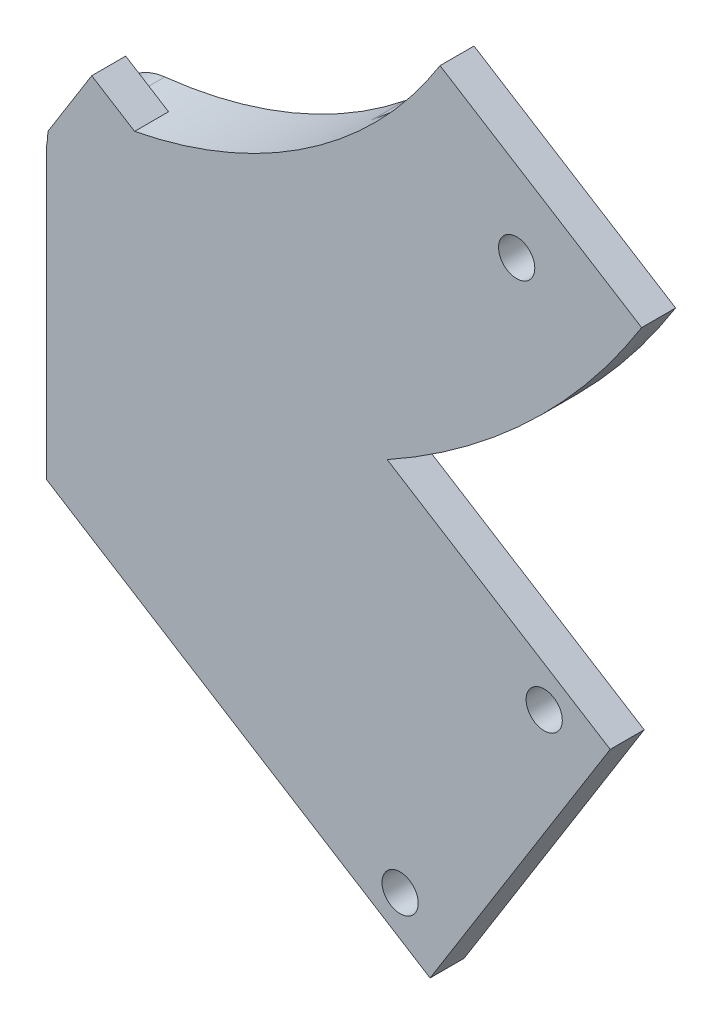
ISO-10303-21;
HEADER;
FILE_DESCRIPTION(('STEP AP214'),'2;1');
FILE_NAME('part.step','',(''),(''),'','','');
FILE_SCHEMA(('AUTOMOTIVE_DESIGN { 1 0 10303 214 1 1 1 1 }'));
ENDSEC;
DATA;
#1=APPLICATION_CONTEXT('core data for automotive mechanical design processes');
#2=APPLICATION_PROTOCOL_DEFINITION('international standard','automotive_design',2000,#1);
#3=PRODUCT_CONTEXT('',#1,'mechanical');
#4=PRODUCT('Part','Part','',(#3));
#5=PRODUCT_RELATED_PRODUCT_CATEGORY('part','',(#4));
#6=PRODUCT_DEFINITION_FORMATION('','',#4);
#7=PRODUCT_DEFINITION_CONTEXT('part definition',#1,'design');
#8=PRODUCT_DEFINITION('design','',#6,#7);
#9=PRODUCT_DEFINITION_SHAPE('','',#8);
#10=(LENGTH_UNIT() NAMED_UNIT(*) SI_UNIT(.MILLI.,.METRE.));
#11=(NAMED_UNIT(*) PLANE_ANGLE_UNIT() SI_UNIT($,.RADIAN.));
#12=(NAMED_UNIT(*) SI_UNIT($,.STERADIAN.) SOLID_ANGLE_UNIT());
#13=UNCERTAINTY_MEASURE_WITH_UNIT(LENGTH_MEASURE(1.E-05),#10,'distance_accuracy_value','');
#14=(GEOMETRIC_REPRESENTATION_CONTEXT(3) GLOBAL_UNCERTAINTY_ASSIGNED_CONTEXT((#13)) GLOBAL_UNIT_ASSIGNED_CONTEXT((#10,
#11,#12)) REPRESENTATION_CONTEXT('',''));
#15=CARTESIAN_POINT('',(0.,0.,0.));
#16=DIRECTION('',(0.,0.,1.));
#17=DIRECTION('',(1.,0.,0.));
#18=AXIS2_PLACEMENT_3D('',#15,#16,#17);
#19=CARTESIAN_POINT('',(-20.3043393145158,10.9865945605942,3.));
#20=DIRECTION('',(0.,0.,-1.));
#21=DIRECTION('',(-1.,0.,0.));
#22=AXIS2_PLACEMENT_3D('',#19,#20,#21);
#23=CYLINDRICAL_SURFACE('',#22,41.);
#24=CARTESIAN_POINT('',(-20.3043393145158,10.9865945605942,3.));
#25=DIRECTION('',(0.,0.,1.));
#26=DIRECTION('',(1.,0.,0.));
#27=AXIS2_PLACEMENT_3D('',#24,#25,#26);
#28=CIRCLE('',#27,41.);
#29=CARTESIAN_POINT('',(-12.5147197082271,-29.2666267563306,3.));
#30=VERTEX_POINT('',#29);
#31=CARTESIAN_POINT('',(-15.8478175753853,-29.7704835239381,3.));
#32=VERTEX_POINT('',#31);
#33=EDGE_CURVE('E231',#30,#32,#28,.F.);
#34=ORIENTED_EDGE('',*,*,#33,.F.);
#35=DIRECTION('',(0.,0.,-1.));
#36=VECTOR('',#35,1.);
#37=CARTESIAN_POINT('',(-12.5147197082271,-29.2666267563306,3.));
#38=LINE('',#37,#36);
#39=CARTESIAN_POINT('',(-12.5147197082271,-29.2666267563306,6.));
#40=VERTEX_POINT('',#39);
#41=EDGE_CURVE('E236',#30,#40,#38,.F.);
#42=ORIENTED_EDGE('',*,*,#41,.T.);
#43=CARTESIAN_POINT('',(-20.3043393145158,10.9865945605942,6.));
#44=DIRECTION('',(0.,0.,-1.));
#45=DIRECTION('',(1.,0.,0.));
#46=AXIS2_PLACEMENT_3D('',#43,#44,#45);
#47=CIRCLE('',#46,41.);
#48=CARTESIAN_POINT('',(14.4587896480223,-10.7510424943837,6.));
#49=VERTEX_POINT('',#48);
#50=EDGE_CURVE('E251',#49,#40,#47,.T.);
#51=ORIENTED_EDGE('',*,*,#50,.F.);
#52=DIRECTION('',(0.,0.,-1.));
#53=VECTOR('',#52,1.);
#54=CARTESIAN_POINT('',(14.4587896480223,-10.7510424943837,6.));
#55=LINE('',#54,#53);
#56=CARTESIAN_POINT('',(14.4587896480223,-10.7510424943837,3.));
#57=VERTEX_POINT('',#56);
#58=EDGE_CURVE('E256',#49,#57,#55,.T.);
#59=ORIENTED_EDGE('',*,*,#58,.T.);
#60=CARTESIAN_POINT('',(-20.3043393145158,10.9865945605942,3.));
#61=DIRECTION('',(0.,0.,-1.));
#62=DIRECTION('',(1.,0.,0.));
#63=AXIS2_PLACEMENT_3D('',#60,#61,#62);
#64=CIRCLE('',#63,41.);
#65=CARTESIAN_POINT('',(5.36403023816226,-20.9842484765726,3.));
#66=VERTEX_POINT('',#65);
#67=EDGE_CURVE('E249',#57,#66,#64,.T.);
#68=ORIENTED_EDGE('',*,*,#67,.T.);
#69=DIRECTION('',(0.,0.,-1.));
#70=VECTOR('',#69,1.);
#71=CARTESIAN_POINT('',(5.36403023816226,-20.9842484765726,3.));
#72=LINE('',#71,#70);
#73=CARTESIAN_POINT('',(5.36403023816226,-20.9842484765726,0.));
#74=VERTEX_POINT('',#73);
#75=EDGE_CURVE('E295',#66,#74,#72,.T.);
#76=ORIENTED_EDGE('',*,*,#75,.T.);
#77=CARTESIAN_POINT('',(-20.3043393145158,10.9865945605942,0.));
#78=DIRECTION('',(0.,0.,-1.));
#79=DIRECTION('',(1.,0.,0.));
#80=AXIS2_PLACEMENT_3D('',#77,#78,#79);
#81=CIRCLE('',#80,41.);
#82=CARTESIAN_POINT('',(-15.8478175753853,-29.7704835239381,0.));
#83=VERTEX_POINT('',#82);
#84=EDGE_CURVE('E267',#74,#83,#81,.T.);
#85=ORIENTED_EDGE('',*,*,#84,.T.);
#86=DIRECTION('',(0.,0.,-1.));
#87=VECTOR('',#86,1.);
#88=CARTESIAN_POINT('',(-15.8478175753853,-29.7704835239381,3.));
#89=LINE('',#88,#87);
#90=EDGE_CURVE('E298',#83,#32,#89,.F.);
#91=ORIENTED_EDGE('',*,*,#90,.T.);
#92=EDGE_LOOP('',(#34,#42,#51,#59,#68,#76,#85,#91));
#93=FACE_BOUND('',#92,.T.);
#94=ADVANCED_FACE('F35',(#93),#23,.F.);
#95=CARTESIAN_POINT('',(-20.3043393145158,-30.0134054394058,3.));
#96=DIRECTION('',(1.,0.,0.));
#97=DIRECTION('',(0.,1.,0.));
#98=AXIS2_PLACEMENT_3D('',#95,#96,#97);
#99=PLANE('',#98);
#100=DIRECTION('',(0.,0.,-1.));
#101=VECTOR('',#100,1.);
#102=CARTESIAN_POINT('',(-20.3043393145158,-34.7408589001005,3.));
#103=LINE('',#102,#101);
#104=CARTESIAN_POINT('',(-20.3043393145158,-34.7408589001005,6.));
#105=VERTEX_POINT('',#104);
#106=CARTESIAN_POINT('',(-20.3043393145158,-34.7408589001005,3.));
#107=VERTEX_POINT('',#106);
#108=EDGE_CURVE('E321',#105,#107,#103,.T.);
#109=ORIENTED_EDGE('',*,*,#108,.T.);
#110=DIRECTION('',(0.,0.,-1.));
#111=VECTOR('',#110,1.);
#112=CARTESIAN_POINT('',(-20.3043393145158,-34.7408589001005,3.));
#113=LINE('',#112,#111);
#114=CARTESIAN_POINT('',(-20.3043393145158,-34.7408589001005,0.));
#115=VERTEX_POINT('',#114);
#116=EDGE_CURVE('E284',#107,#115,#113,.T.);
#117=ORIENTED_EDGE('',*,*,#116,.T.);
#118=DIRECTION('',(0.,-1.,0.));
#119=VECTOR('',#118,1.);
#120=CARTESIAN_POINT('',(-20.3043393145158,-30.0134054394058,0.));
#121=LINE('',#120,#119);
#122=CARTESIAN_POINT('',(-20.3043393145158,-45.7936837057194,0.));
#123=VERTEX_POINT('',#122);
#124=EDGE_CURVE('E275',#115,#123,#121,.T.);
#125=ORIENTED_EDGE('',*,*,#124,.T.);
#126=DIRECTION('',(0.,0.,-1.));
#127=VECTOR('',#126,1.);
#128=CARTESIAN_POINT('',(-20.3043393145158,-45.7936837057194,3.));
#129=LINE('',#128,#127);
#130=CARTESIAN_POINT('',(-20.3043393145158,-45.7936837057194,3.));
#131=VERTEX_POINT('',#130);
#132=EDGE_CURVE('E271',#123,#131,#129,.F.);
#133=ORIENTED_EDGE('',*,*,#132,.T.);
#134=DIRECTION('',(0.,-1.,0.));
#135=VECTOR('',#134,1.);
#136=CARTESIAN_POINT('',(-20.3043393145158,-34.7408589001005,3.));
#137=LINE('',#136,#135);
#138=CARTESIAN_POINT('',(-20.3043393145158,-59.7780366281282,3.));
#139=VERTEX_POINT('',#138);
#140=EDGE_CURVE('E192',#131,#139,#137,.T.);
#141=ORIENTED_EDGE('',*,*,#140,.T.);
#142=DIRECTION('',(0.,0.,1.));
#143=VECTOR('',#142,1.);
#144=CARTESIAN_POINT('',(-20.3043393145158,-59.7780366281282,3.));
#145=LINE('',#144,#143);
#146=CARTESIAN_POINT('',(-20.3043393145158,-59.7780366281282,6.));
#147=VERTEX_POINT('',#146);
#148=EDGE_CURVE('E187',#139,#147,#145,.T.);
#149=ORIENTED_EDGE('',*,*,#148,.T.);
#150=DIRECTION('',(0.,-1.,0.));
#151=VECTOR('',#150,1.);
#152=CARTESIAN_POINT('',(-20.3043393145158,-30.0134054394058,6.));
#153=LINE('',#152,#151);
#154=EDGE_CURVE('E254',#105,#147,#153,.T.);
#155=ORIENTED_EDGE('',*,*,#154,.F.);
#156=EDGE_LOOP('',(#109,#117,#125,#133,#141,#149,#155));
#157=FACE_BOUND('',#156,.T.);
#158=ADVANCED_FACE('F326',(#157),#99,.F.);
#159=CARTESIAN_POINT('',(-20.3043393145158,10.9865945605942,3.));
#160=DIRECTION('',(0.,0.,-1.));
#161=DIRECTION('',(-1.,0.,0.));
#162=AXIS2_PLACEMENT_3D('',#159,#160,#161);
#163=CYLINDRICAL_SURFACE('',#162,62.);
#164=CARTESIAN_POINT('',(-20.3043393145158,10.9865945605942,6.));
#165=DIRECTION('',(0.,0.,1.));
#166=DIRECTION('',(1.,0.,0.));
#167=AXIS2_PLACEMENT_3D('',#164,#165,#166);
#168=CIRCLE('',#167,62.);
#169=CARTESIAN_POINT('',(9.79495296132929,-43.217027131072,6.));
#170=VERTEX_POINT('',#169);
#171=CARTESIAN_POINT('',(32.2642947263955,-21.8849541566894,6.));
#172=VERTEX_POINT('',#171);
#173=EDGE_CURVE('E246',#170,#172,#168,.T.);
#174=ORIENTED_EDGE('',*,*,#173,.F.);
#175=DIRECTION('',(0.,0.,-1.));
#176=VECTOR('',#175,1.);
#177=CARTESIAN_POINT('',(9.79495296132926,-43.2170271310719,3.));
#178=LINE('',#177,#176);
#179=CARTESIAN_POINT('',(9.79495296132925,-43.2170271310719,3.));
#180=VERTEX_POINT('',#179);
#181=EDGE_CURVE('E233',#170,#180,#178,.T.);
#182=ORIENTED_EDGE('',*,*,#181,.T.);
#183=CARTESIAN_POINT('',(-20.3043393145158,10.9865945605942,3.));
#184=DIRECTION('',(0.,0.,1.));
#185=DIRECTION('',(1.,0.,0.));
#186=AXIS2_PLACEMENT_3D('',#183,#184,#185);
#187=CIRCLE('',#186,62.);
#188=CARTESIAN_POINT('',(-14.8657428232877,-50.7744098694311,3.));
#189=VERTEX_POINT('',#188);
#190=EDGE_CURVE('E222',#189,#180,#187,.T.);
#191=ORIENTED_EDGE('',*,*,#190,.F.);
#192=DIRECTION('',(0.,0.,-1.));
#193=VECTOR('',#192,1.);
#194=CARTESIAN_POINT('',(-14.8657428232877,-50.7744098694311,3.));
#195=LINE('',#194,#193);
#196=CARTESIAN_POINT('',(-14.8657428232877,-50.7744098694311,0.));
#197=VERTEX_POINT('',#196);
#198=EDGE_CURVE('E314',#189,#197,#195,.T.);
#199=ORIENTED_EDGE('',*,*,#198,.T.);
#200=CARTESIAN_POINT('',(-20.3043393145158,10.9865945605942,0.));
#201=DIRECTION('',(0.,0.,1.));
#202=DIRECTION('',(1.,0.,0.));
#203=AXIS2_PLACEMENT_3D('',#200,#201,#202);
#204=CIRCLE('',#203,62.);
#205=CARTESIAN_POINT('',(19.5216172717629,-36.5306989438538,0.));
#206=VERTEX_POINT('',#205);
#207=EDGE_CURVE('E278',#197,#206,#204,.T.);
#208=ORIENTED_EDGE('',*,*,#207,.T.);
#209=DIRECTION('',(0.,0.,-1.));
#210=VECTOR('',#209,1.);
#211=CARTESIAN_POINT('',(19.5216172717629,-36.5306989438538,3.));
#212=LINE('',#211,#210);
#213=CARTESIAN_POINT('',(19.5216172717629,-36.5306989438538,3.));
#214=VERTEX_POINT('',#213);
#215=EDGE_CURVE('E312',#206,#214,#212,.F.);
#216=ORIENTED_EDGE('',*,*,#215,.T.);
#217=CARTESIAN_POINT('',(-20.3043393145158,10.9865945605942,3.));
#218=DIRECTION('',(0.,0.,1.));
#219=DIRECTION('',(1.,0.,0.));
#220=AXIS2_PLACEMENT_3D('',#217,#218,#219);
#221=CIRCLE('',#220,62.);
#222=CARTESIAN_POINT('',(32.2642947263955,-21.8849541566894,3.));
#223=VERTEX_POINT('',#222);
#224=EDGE_CURVE('E243',#214,#223,#221,.T.);
#225=ORIENTED_EDGE('',*,*,#224,.T.);
#226=DIRECTION('',(0.,0.,-1.));
#227=VECTOR('',#226,1.);
#228=CARTESIAN_POINT('',(32.2642947263955,-21.8849541566894,6.));
#229=LINE('',#228,#227);
#230=EDGE_CURVE('E264',#172,#223,#229,.T.);
#231=ORIENTED_EDGE('',*,*,#230,.F.);
#232=EDGE_LOOP('',(#174,#182,#191,#199,#208,#216,#225,#231));
#233=FACE_BOUND('',#232,.T.);
#234=ADVANCED_FACE('F357',(#233),#163,.T.);
#235=CARTESIAN_POINT('',(8.68703871413273,-18.0047834680542,3.));
#236=DIRECTION('',(-0.707106781186546,-0.707106781186549,0.));
#237=DIRECTION('',(0.707106781186549,-0.707106781186546,0.));
#238=AXIS2_PLACEMENT_3D('',#235,#236,#237);
#239=PLANE('',#238);
#240=DIRECTION('',(-0.707106781186549,0.707106781186546,0.));
#241=VECTOR('',#240,1.);
#242=CARTESIAN_POINT('',(8.68703871413273,-18.0047834680542,3.));
#243=LINE('',#242,#241);
#244=CARTESIAN_POINT('',(19.8453804852538,-29.1631252391752,3.));
#245=VERTEX_POINT('',#244);
#246=CARTESIAN_POINT('',(12.0298531139338,-21.3475978678553,3.));
#247=VERTEX_POINT('',#246);
#248=EDGE_CURVE('E268',#245,#247,#243,.T.);
#249=ORIENTED_EDGE('',*,*,#248,.F.);
#250=DIRECTION('',(0.,0.,-1.));
#251=VECTOR('',#250,1.);
#252=CARTESIAN_POINT('',(19.8453804852538,-29.1631252391752,3.));
#253=LINE('',#252,#251);
#254=CARTESIAN_POINT('',(19.8453804852538,-29.1631252391752,0.));
#255=VERTEX_POINT('',#254);
#256=EDGE_CURVE('E318',#245,#255,#253,.T.);
#257=ORIENTED_EDGE('',*,*,#256,.T.);
#258=DIRECTION('',(-0.707106781186549,0.707106781186546,0.));
#259=VECTOR('',#258,1.);
#260=CARTESIAN_POINT('',(8.68703871413273,-18.0047834680542,0.));
#261=LINE('',#260,#259);
#262=CARTESIAN_POINT('',(12.0298531139338,-21.3475978678553,0.));
#263=VERTEX_POINT('',#262);
#264=EDGE_CURVE('E272',#255,#263,#261,.T.);
#265=ORIENTED_EDGE('',*,*,#264,.T.);
#266=DIRECTION('',(0.,0.,-1.));
#267=VECTOR('',#266,1.);
#268=CARTESIAN_POINT('',(12.0298531139338,-21.3475978678553,3.));
#269=LINE('',#268,#267);
#270=EDGE_CURVE('E57',#263,#247,#269,.F.);
#271=ORIENTED_EDGE('',*,*,#270,.T.);
#272=EDGE_LOOP('',(#249,#257,#265,#271));
#273=FACE_BOUND('',#272,.T.);
#274=ADVANCED_FACE('F349',(#273),#239,.F.);
#275=CARTESIAN_POINT('',(-20.3043393145158,10.9865945605942,0.));
#276=DIRECTION('',(0.,0.,1.));
#277=DIRECTION('',(1.,0.,0.));
#278=AXIS2_PLACEMENT_3D('',#275,#276,#277);
#279=PLANE('',#278);
#280=ORIENTED_EDGE('',*,*,#124,.F.);
#281=CARTESIAN_POINT('',(-15.3043393145158,-34.7408589001005,0.));
#282=DIRECTION('',(0.,0.,1.));
#283=DIRECTION('',(1.,0.,0.));
#284=AXIS2_PLACEMENT_3D('',#281,#282,#283);
#285=CIRCLE('',#284,5.);
#286=EDGE_CURVE('E293',#115,#83,#285,.F.);
#287=ORIENTED_EDGE('',*,*,#286,.T.);
#288=ORIENTED_EDGE('',*,*,#84,.F.);
#289=CARTESIAN_POINT('',(8.49431920800105,-24.883131773788,0.));
#290=DIRECTION('',(0.,0.,1.));
#291=DIRECTION('',(1.,0.,0.));
#292=AXIS2_PLACEMENT_3D('',#289,#290,#291);
#293=CIRCLE('',#292,5.);
#294=EDGE_CURVE('E287',#74,#263,#293,.F.);
#295=ORIENTED_EDGE('',*,*,#294,.T.);
#296=ORIENTED_EDGE('',*,*,#264,.F.);
#297=CARTESIAN_POINT('',(16.309846579321,-32.698659145108,0.));
#298=DIRECTION('',(0.,0.,1.));
#299=DIRECTION('',(1.,0.,0.));
#300=AXIS2_PLACEMENT_3D('',#297,#298,#299);
#301=CIRCLE('',#300,5.);
#302=EDGE_CURVE('E289',#255,#206,#301,.F.);
#303=ORIENTED_EDGE('',*,*,#302,.T.);
#304=ORIENTED_EDGE('',*,*,#207,.F.);
#305=CARTESIAN_POINT('',(-15.3043393145158,-45.7936837057194,0.));
#306=DIRECTION('',(0.,0.,1.));
#307=DIRECTION('',(1.,0.,0.));
#308=AXIS2_PLACEMENT_3D('',#305,#306,#307);
#309=CIRCLE('',#308,5.);
#310=EDGE_CURVE('E291',#197,#123,#309,.F.);
#311=ORIENTED_EDGE('',*,*,#310,.T.);
#312=EDGE_LOOP('',(#280,#287,#288,#295,#296,#303,#304,#311));
#313=FACE_BOUND('',#312,.T.);
#314=ADVANCED_FACE('F336',(#313),#279,.F.);
#315=CARTESIAN_POINT('',(-15.3043393145158,-34.7408589001005,3.));
#316=DIRECTION('',(0.,0.,-1.));
#317=DIRECTION('',(-1.,0.,0.));
#318=AXIS2_PLACEMENT_3D('',#315,#316,#317);
#319=CYLINDRICAL_SURFACE('',#318,5.);
#320=CARTESIAN_POINT('',(-15.3043393145158,-34.7408589001005,3.));
#321=DIRECTION('',(0.,0.,1.));
#322=DIRECTION('',(1.,0.,0.));
#323=AXIS2_PLACEMENT_3D('',#320,#321,#322);
#324=CIRCLE('',#323,5.);
#325=CARTESIAN_POINT('',(-19.543745285557,-32.0899275519325,3.));
#326=VERTEX_POINT('',#325);
#327=EDGE_CURVE('E310',#32,#326,#324,.T.);
#328=ORIENTED_EDGE('',*,*,#327,.F.);
#329=ORIENTED_EDGE('',*,*,#90,.F.);
#330=ORIENTED_EDGE('',*,*,#286,.F.);
#331=ORIENTED_EDGE('',*,*,#116,.F.);
#332=CARTESIAN_POINT('',(-20.2296538762221,-33.8798847609749,3.));
#333=VERTEX_POINT('',#332);
#334=EDGE_CURVE('E309',#333,#107,#324,.T.);
#335=ORIENTED_EDGE('',*,*,#334,.F.);
#336=CARTESIAN_POINT('',(-15.3043393145158,-34.7408589001005,3.));
#337=DIRECTION('',(0.,0.,1.));
#338=DIRECTION('',(1.,0.,0.));
#339=AXIS2_PLACEMENT_3D('',#336,#337,#338);
#340=CIRCLE('',#339,5.);
#341=EDGE_CURVE('E191',#333,#326,#340,.F.);
#342=ORIENTED_EDGE('',*,*,#341,.T.);
#343=EDGE_LOOP('',(#328,#329,#330,#331,#335,#342));
#344=FACE_BOUND('',#343,.T.);
#345=ADVANCED_FACE('F332',(#344),#319,.T.);
#346=CARTESIAN_POINT('',(-15.3043393145158,-45.7936837057194,3.));
#347=DIRECTION('',(0.,0.,-1.));
#348=DIRECTION('',(-1.,0.,0.));
#349=AXIS2_PLACEMENT_3D('',#346,#347,#348);
#350=CYLINDRICAL_SURFACE('',#349,5.);
#351=CARTESIAN_POINT('',(-15.3043393145158,-45.7936837057194,3.));
#352=DIRECTION('',(0.,0.,1.));
#353=DIRECTION('',(1.,0.,0.));
#354=AXIS2_PLACEMENT_3D('',#351,#352,#353);
#355=CIRCLE('',#354,5.);
#356=EDGE_CURVE('E307',#131,#189,#355,.T.);
#357=ORIENTED_EDGE('',*,*,#356,.F.);
#358=ORIENTED_EDGE('',*,*,#132,.F.);
#359=ORIENTED_EDGE('',*,*,#310,.F.);
#360=ORIENTED_EDGE('',*,*,#198,.F.);
#361=EDGE_LOOP('',(#357,#358,#359,#360));
#362=FACE_BOUND('',#361,.T.);
#363=ADVANCED_FACE('F362',(#362),#350,.T.);
#364=CARTESIAN_POINT('',(16.309846579321,-32.698659145108,3.));
#365=DIRECTION('',(0.,0.,-1.));
#366=DIRECTION('',(-1.,0.,0.));
#367=AXIS2_PLACEMENT_3D('',#364,#365,#366);
#368=CYLINDRICAL_SURFACE('',#367,5.);
#369=CARTESIAN_POINT('',(16.309846579321,-32.698659145108,3.));
#370=DIRECTION('',(0.,0.,1.));
#371=DIRECTION('',(1.,0.,0.));
#372=AXIS2_PLACEMENT_3D('',#369,#370,#371);
#373=CIRCLE('',#372,5.);
#374=EDGE_CURVE('E304',#214,#245,#373,.T.);
#375=ORIENTED_EDGE('',*,*,#374,.F.);
#376=ORIENTED_EDGE('',*,*,#215,.F.);
#377=ORIENTED_EDGE('',*,*,#302,.F.);
#378=ORIENTED_EDGE('',*,*,#256,.F.);
#379=EDGE_LOOP('',(#375,#376,#377,#378));
#380=FACE_BOUND('',#379,.T.);
#381=ADVANCED_FACE('F352',(#380),#368,.T.);
#382=CARTESIAN_POINT('',(8.49431920800105,-24.883131773788,3.));
#383=DIRECTION('',(0.,0.,-1.));
#384=DIRECTION('',(-1.,0.,0.));
#385=AXIS2_PLACEMENT_3D('',#382,#383,#384);
#386=CYLINDRICAL_SURFACE('',#385,5.);
#387=CARTESIAN_POINT('',(8.49431920800105,-24.883131773788,3.));
#388=DIRECTION('',(0.,0.,1.));
#389=DIRECTION('',(1.,0.,0.));
#390=AXIS2_PLACEMENT_3D('',#387,#388,#389);
#391=CIRCLE('',#390,5.);
#392=EDGE_CURVE('E301',#247,#66,#391,.T.);
#393=ORIENTED_EDGE('',*,*,#392,.F.);
#394=ORIENTED_EDGE('',*,*,#270,.F.);
#395=ORIENTED_EDGE('',*,*,#294,.F.);
#396=ORIENTED_EDGE('',*,*,#75,.F.);
#397=EDGE_LOOP('',(#393,#394,#395,#396));
#398=FACE_BOUND('',#397,.T.);
#399=ADVANCED_FACE('F341',(#398),#386,.T.);
#400=CARTESIAN_POINT('',(-20.3043393145158,10.9865945605942,6.));
#401=DIRECTION('',(0.,0.,1.));
#402=DIRECTION('',(1.,0.,0.));
#403=AXIS2_PLACEMENT_3D('',#400,#401,#402);
#404=PLANE('',#403);
#405=DIRECTION('',(-0.847881194208247,0.530186269633605,0.));
#406=VECTOR('',#405,1.);
#407=CARTESIAN_POINT('',(-16.2987314740915,-26.900456712582,6.));
#408=LINE('',#407,#406);
#409=CARTESIAN_POINT('',(29.4868530131538,-55.5305152727967,6.));
#410=VERTEX_POINT('',#409);
#411=EDGE_CURVE('E179',#410,#170,#408,.T.);
#412=ORIENTED_EDGE('',*,*,#411,.T.);
#413=ORIENTED_EDGE('',*,*,#173,.T.);
#414=DIRECTION('',(-0.847881194208246,0.530186269633605,0.));
#415=VECTOR('',#414,1.);
#416=CARTESIAN_POINT('',(14.4587896480223,-10.7510424943837,6.));
#417=LINE('',#416,#415);
#418=EDGE_CURVE('E248',#172,#49,#417,.T.);
#419=ORIENTED_EDGE('',*,*,#418,.T.);
#420=ORIENTED_EDGE('',*,*,#50,.T.);
#421=CARTESIAN_POINT('',(-16.2987314740915,-26.900456712582,6.));
#422=VERTEX_POINT('',#421);
#423=EDGE_CURVE('E216',#40,#422,#408,.T.);
#424=ORIENTED_EDGE('',*,*,#423,.T.);
#425=DIRECTION('',(-0.530186269633605,-0.847881194208247,0.));
#426=VECTOR('',#425,1.);
#427=CARTESIAN_POINT('',(-16.2987314740915,-26.900456712582,6.));
#428=LINE('',#427,#426);
#429=CARTESIAN_POINT('',(-20.1598525594258,-33.0752148010521,6.));
#430=VERTEX_POINT('',#429);
#431=EDGE_CURVE('E206',#422,#430,#428,.T.);
#432=ORIENTED_EDGE('',*,*,#431,.T.);
#433=DIRECTION('',(-0.0864207372646388,-0.996258729532964,0.));
#434=VECTOR('',#433,1.);
#435=CARTESIAN_POINT('',(-20.3043393145158,-34.7408589001005,6.));
#436=LINE('',#435,#434);
#437=CARTESIAN_POINT('',(-20.2296538762221,-33.8798847609749,6.));
#438=VERTEX_POINT('',#437);
#439=EDGE_CURVE('E186',#430,#438,#436,.T.);
#440=ORIENTED_EDGE('',*,*,#439,.T.);
#441=CARTESIAN_POINT('',(-15.3043393145158,-34.7408589001005,6.));
#442=DIRECTION('',(0.,0.,1.));
#443=DIRECTION('',(1.,0.,0.));
#444=AXIS2_PLACEMENT_3D('',#441,#442,#443);
#445=CIRCLE('',#444,5.);
#446=EDGE_CURVE('E43',#438,#105,#445,.T.);
#447=ORIENTED_EDGE('',*,*,#446,.T.);
#448=ORIENTED_EDGE('',*,*,#154,.T.);
#449=DIRECTION('',(0.847881194208247,-0.530186269633605,0.));
#450=VECTOR('',#449,1.);
#451=CARTESIAN_POINT('',(-20.3043393145158,-59.7780366281282,6.));
#452=LINE('',#451,#450);
#453=CARTESIAN_POINT('',(13.5812649241457,-80.9669510990441,6.));
#454=VERTEX_POINT('',#453);
#455=EDGE_CURVE('E210',#147,#454,#452,.T.);
#456=ORIENTED_EDGE('',*,*,#455,.T.);
#457=DIRECTION('',(0.530186269633605,0.847881194208247,0.));
#458=VECTOR('',#457,1.);
#459=CARTESIAN_POINT('',(13.5812649241457,-80.9669510990441,6.));
#460=LINE('',#459,#458);
#461=EDGE_CURVE('E213',#454,#410,#460,.T.);
#462=ORIENTED_EDGE('',*,*,#461,.T.);
#463=EDGE_LOOP('',(#412,#413,#419,#420,#424,#432,#440,#447,#448,#456,#462));
#464=FACE_BOUND('',#463,.T.);
#465=CARTESIAN_POINT('',(23.6568882332118,-55.4232275072534,6.));
#466=DIRECTION('',(0.,0.,1.));
#467=DIRECTION('',(1.,0.,0.));
#468=AXIS2_PLACEMENT_3D('',#465,#466,#467);
#469=CIRCLE('',#468,1.6);
#470=CARTESIAN_POINT('',(25.2568882332118,-55.4232275072534,6.));
#471=VERTEX_POINT('',#470);
#472=EDGE_CURVE('E384',#471,#471,#469,.T.);
#473=ORIENTED_EDGE('',*,*,#472,.F.);
#474=EDGE_LOOP('',(#473));
#475=FACE_BOUND('',#474,.T.);
#476=CARTESIAN_POINT('',(10.9324177620052,-75.7723761682513,6.));
#477=DIRECTION('',(0.,0.,1.));
#478=DIRECTION('',(1.,0.,0.));
#479=AXIS2_PLACEMENT_3D('',#476,#477,#478);
#480=CIRCLE('',#479,1.6);
#481=CARTESIAN_POINT('',(12.5324177620052,-75.7723761682513,6.));
#482=VERTEX_POINT('',#481);
#483=EDGE_CURVE('E388',#482,#482,#480,.T.);
#484=ORIENTED_EDGE('',*,*,#483,.F.);
#485=EDGE_LOOP('',(#484));
#486=FACE_BOUND('',#485,.T.);
#487=CARTESIAN_POINT('',(21.22767610074,-22.0601394804229,6.));
#488=DIRECTION('',(0.,0.,1.));
#489=DIRECTION('',(1.,0.,0.));
#490=AXIS2_PLACEMENT_3D('',#487,#488,#489);
#491=CIRCLE('',#490,1.6);
#492=CARTESIAN_POINT('',(22.82767610074,-22.0601394804229,6.));
#493=VERTEX_POINT('',#492);
#494=EDGE_CURVE('E240',#493,#493,#491,.T.);
#495=ORIENTED_EDGE('',*,*,#494,.F.);
#496=EDGE_LOOP('',(#495));
#497=FACE_BOUND('',#496,.T.);
#498=ADVANCED_FACE('F377',(#464,#475,#486,#497),#404,.T.);
#499=CARTESIAN_POINT('',(-20.3043393145158,10.9865945605942,3.));
#500=DIRECTION('',(0.,0.,1.));
#501=DIRECTION('',(1.,0.,0.));
#502=AXIS2_PLACEMENT_3D('',#499,#500,#501);
#503=PLANE('',#502);
#504=ORIENTED_EDGE('',*,*,#224,.F.);
#505=ORIENTED_EDGE('',*,*,#374,.T.);
#506=ORIENTED_EDGE('',*,*,#248,.T.);
#507=ORIENTED_EDGE('',*,*,#392,.T.);
#508=ORIENTED_EDGE('',*,*,#67,.F.);
#509=DIRECTION('',(-0.847881194208246,0.530186269633605,0.));
#510=VECTOR('',#509,1.);
#511=CARTESIAN_POINT('',(14.4587896480223,-10.7510424943837,3.));
#512=LINE('',#511,#510);
#513=EDGE_CURVE('E258',#223,#57,#512,.T.);
#514=ORIENTED_EDGE('',*,*,#513,.F.);
#515=EDGE_LOOP('',(#504,#505,#506,#507,#508,#514));
#516=FACE_BOUND('',#515,.T.);
#517=CARTESIAN_POINT('',(21.22767610074,-22.0601394804229,3.));
#518=DIRECTION('',(0.,0.,1.));
#519=DIRECTION('',(1.,0.,0.));
#520=AXIS2_PLACEMENT_3D('',#517,#518,#519);
#521=CIRCLE('',#520,1.6);
#522=CARTESIAN_POINT('',(22.82767610074,-22.0601394804229,3.));
#523=VERTEX_POINT('',#522);
#524=EDGE_CURVE('E239',#523,#523,#521,.T.);
#525=ORIENTED_EDGE('',*,*,#524,.T.);
#526=EDGE_LOOP('',(#525));
#527=FACE_BOUND('',#526,.T.);
#528=ADVANCED_FACE('F344',(#516,#527),#503,.F.);
#529=CARTESIAN_POINT('',(14.4587896480223,-10.7510424943837,6.));
#530=DIRECTION('',(-0.530186269633605,-0.847881194208246,0.));
#531=DIRECTION('',(0.847881194208247,-0.530186269633605,0.));
#532=AXIS2_PLACEMENT_3D('',#529,#530,#531);
#533=PLANE('',#532);
#534=ORIENTED_EDGE('',*,*,#513,.T.);
#535=ORIENTED_EDGE('',*,*,#58,.F.);
#536=ORIENTED_EDGE('',*,*,#418,.F.);
#537=ORIENTED_EDGE('',*,*,#230,.T.);
#538=EDGE_LOOP('',(#534,#535,#536,#537));
#539=FACE_BOUND('',#538,.T.);
#540=ADVANCED_FACE('F394',(#539),#533,.F.);
#541=CARTESIAN_POINT('',(21.22767610074,-22.0601394804229,6.));
#542=DIRECTION('',(0.,0.,-1.));
#543=DIRECTION('',(-1.,0.,0.));
#544=AXIS2_PLACEMENT_3D('',#541,#542,#543);
#545=CYLINDRICAL_SURFACE('',#544,1.6);
#546=ORIENTED_EDGE('',*,*,#494,.T.);
#547=EDGE_LOOP('',(#546));
#548=FACE_BOUND('',#547,.T.);
#549=ORIENTED_EDGE('',*,*,#524,.F.);
#550=EDGE_LOOP('',(#549));
#551=FACE_BOUND('',#550,.T.);
#552=ADVANCED_FACE('F391',(#548,#551),#545,.F.);
#553=CARTESIAN_POINT('',(-15.3043393145158,-34.7408589001005,3.));
#554=DIRECTION('',(0.,0.,-1.));
#555=DIRECTION('',(-1.,0.,0.));
#556=AXIS2_PLACEMENT_3D('',#553,#554,#555);
#557=CYLINDRICAL_SURFACE('',#556,5.);
#558=DIRECTION('',(0.,0.,-1.));
#559=VECTOR('',#558,1.);
#560=CARTESIAN_POINT('',(-20.2296538762221,-33.8798847609749,3.));
#561=LINE('',#560,#559);
#562=EDGE_CURVE('E11',#333,#438,#561,.F.);
#563=ORIENTED_EDGE('',*,*,#562,.F.);
#564=ORIENTED_EDGE('',*,*,#334,.T.);
#565=ORIENTED_EDGE('',*,*,#108,.F.);
#566=ORIENTED_EDGE('',*,*,#446,.F.);
#567=EDGE_LOOP('',(#563,#564,#565,#566));
#568=FACE_BOUND('',#567,.T.);
#569=ADVANCED_FACE('F37',(#568),#557,.T.);
#570=CARTESIAN_POINT('',(13.5812649241457,-80.9669510990441,3.));
#571=DIRECTION('',(0.847881194208247,-0.530186269633604,0.));
#572=DIRECTION('',(0.530186269633604,0.847881194208247,0.));
#573=AXIS2_PLACEMENT_3D('',#570,#571,#572);
#574=PLANE('',#573);
#575=ORIENTED_EDGE('',*,*,#461,.F.);
#576=DIRECTION('',(0.,0.,1.));
#577=VECTOR('',#576,1.);
#578=CARTESIAN_POINT('',(13.5812649241457,-80.9669510990441,3.));
#579=LINE('',#578,#577);
#580=CARTESIAN_POINT('',(13.5812649241457,-80.9669510990441,3.));
#581=VERTEX_POINT('',#580);
#582=EDGE_CURVE('E225',#581,#454,#579,.T.);
#583=ORIENTED_EDGE('',*,*,#582,.F.);
#584=DIRECTION('',(0.530186269633605,0.847881194208247,0.));
#585=VECTOR('',#584,1.);
#586=CARTESIAN_POINT('',(13.5812649241457,-80.9669510990441,3.));
#587=LINE('',#586,#585);
#588=CARTESIAN_POINT('',(29.4868530131538,-55.5305152727967,3.));
#589=VERTEX_POINT('',#588);
#590=EDGE_CURVE('E200',#581,#589,#587,.T.);
#591=ORIENTED_EDGE('',*,*,#590,.T.);
#592=DIRECTION('',(0.,0.,1.));
#593=VECTOR('',#592,1.);
#594=CARTESIAN_POINT('',(29.4868530131538,-55.5305152727967,3.));
#595=LINE('',#594,#593);
#596=EDGE_CURVE('E223',#589,#410,#595,.T.);
#597=ORIENTED_EDGE('',*,*,#596,.T.);
#598=EDGE_LOOP('',(#575,#583,#591,#597));
#599=FACE_BOUND('',#598,.T.);
#600=ADVANCED_FACE('F375',(#599),#574,.T.);
#601=CARTESIAN_POINT('',(-20.3043393145158,-59.7780366281282,3.));
#602=DIRECTION('',(-0.530186269633605,-0.847881194208246,0.));
#603=DIRECTION('',(0.847881194208247,-0.530186269633605,0.));
#604=AXIS2_PLACEMENT_3D('',#601,#602,#603);
#605=PLANE('',#604);
#606=ORIENTED_EDGE('',*,*,#455,.F.);
#607=ORIENTED_EDGE('',*,*,#148,.F.);
#608=DIRECTION('',(0.847881194208247,-0.530186269633605,0.));
#609=VECTOR('',#608,1.);
#610=CARTESIAN_POINT('',(-20.3043393145158,-59.7780366281282,3.));
#611=LINE('',#610,#609);
#612=EDGE_CURVE('E194',#139,#581,#611,.T.);
#613=ORIENTED_EDGE('',*,*,#612,.T.);
#614=ORIENTED_EDGE('',*,*,#582,.T.);
#615=EDGE_LOOP('',(#606,#607,#613,#614));
#616=FACE_BOUND('',#615,.T.);
#617=ADVANCED_FACE('F369',(#616),#605,.T.);
#618=CARTESIAN_POINT('',(10.9324177620052,-75.7723761682513,3.));
#619=DIRECTION('',(0.,0.,1.));
#620=DIRECTION('',(1.,0.,0.));
#621=AXIS2_PLACEMENT_3D('',#618,#619,#620);
#622=CYLINDRICAL_SURFACE('',#621,1.6);
#623=CARTESIAN_POINT('',(10.9324177620052,-75.7723761682513,3.));
#624=DIRECTION('',(0.,0.,1.));
#625=DIRECTION('',(1.,0.,0.));
#626=AXIS2_PLACEMENT_3D('',#623,#624,#625);
#627=CIRCLE('',#626,1.6);
#628=CARTESIAN_POINT('',(12.5324177620052,-75.7723761682513,3.));
#629=VERTEX_POINT('',#628);
#630=EDGE_CURVE('E550',#629,#629,#627,.T.);
#631=ORIENTED_EDGE('',*,*,#630,.F.);
#632=EDGE_LOOP('',(#631));
#633=FACE_BOUND('',#632,.T.);
#634=ORIENTED_EDGE('',*,*,#483,.T.);
#635=EDGE_LOOP('',(#634));
#636=FACE_BOUND('',#635,.T.);
#637=ADVANCED_FACE('F457',(#633,#636),#622,.F.);
#638=CARTESIAN_POINT('',(23.6568882332118,-55.4232275072534,3.));
#639=DIRECTION('',(0.,0.,1.));
#640=DIRECTION('',(1.,0.,0.));
#641=AXIS2_PLACEMENT_3D('',#638,#639,#640);
#642=CYLINDRICAL_SURFACE('',#641,1.6);
#643=CARTESIAN_POINT('',(23.6568882332118,-55.4232275072534,3.));
#644=DIRECTION('',(0.,0.,1.));
#645=DIRECTION('',(1.,0.,0.));
#646=AXIS2_PLACEMENT_3D('',#643,#644,#645);
#647=CIRCLE('',#646,1.6);
#648=CARTESIAN_POINT('',(25.2568882332118,-55.4232275072534,3.));
#649=VERTEX_POINT('',#648);
#650=EDGE_CURVE('E208',#649,#649,#647,.T.);
#651=ORIENTED_EDGE('',*,*,#650,.F.);
#652=EDGE_LOOP('',(#651));
#653=FACE_BOUND('',#652,.T.);
#654=ORIENTED_EDGE('',*,*,#472,.T.);
#655=EDGE_LOOP('',(#654));
#656=FACE_BOUND('',#655,.T.);
#657=ADVANCED_FACE('F466',(#653,#656),#642,.F.);
#658=CARTESIAN_POINT('',(0.,0.,3.));
#659=DIRECTION('',(0.,0.,1.));
#660=DIRECTION('',(1.,0.,0.));
#661=AXIS2_PLACEMENT_3D('',#658,#659,#660);
#662=PLANE('',#661);
#663=ORIENTED_EDGE('',*,*,#650,.T.);
#664=EDGE_LOOP('',(#663));
#665=FACE_BOUND('',#664,.T.);
#666=ORIENTED_EDGE('',*,*,#630,.T.);
#667=EDGE_LOOP('',(#666));
#668=FACE_BOUND('',#667,.T.);
#669=ORIENTED_EDGE('',*,*,#356,.T.);
#670=ORIENTED_EDGE('',*,*,#190,.T.);
#671=DIRECTION('',(-0.847881194208247,0.530186269633605,0.));
#672=VECTOR('',#671,1.);
#673=CARTESIAN_POINT('',(-16.2987314740915,-26.900456712582,3.));
#674=LINE('',#673,#672);
#675=EDGE_CURVE('E188',#589,#180,#674,.T.);
#676=ORIENTED_EDGE('',*,*,#675,.F.);
#677=ORIENTED_EDGE('',*,*,#590,.F.);
#678=ORIENTED_EDGE('',*,*,#612,.F.);
#679=ORIENTED_EDGE('',*,*,#140,.F.);
#680=EDGE_LOOP('',(#669,#670,#676,#677,#678,#679));
#681=FACE_BOUND('',#680,.T.);
#682=ADVANCED_FACE('F371',(#665,#668,#681),#662,.F.);
#683=CARTESIAN_POINT('',(-16.2987314740915,-26.900456712582,3.));
#684=DIRECTION('',(0.530186269633605,0.847881194208246,0.));
#685=DIRECTION('',(-0.847881194208247,0.530186269633605,0.));
#686=AXIS2_PLACEMENT_3D('',#683,#684,#685);
#687=PLANE('',#686);
#688=ORIENTED_EDGE('',*,*,#181,.F.);
#689=ORIENTED_EDGE('',*,*,#411,.F.);
#690=ORIENTED_EDGE('',*,*,#596,.F.);
#691=ORIENTED_EDGE('',*,*,#675,.T.);
#692=EDGE_LOOP('',(#688,#689,#690,#691));
#693=FACE_BOUND('',#692,.T.);
#694=ADVANCED_FACE('F485',(#693),#687,.T.);
#695=ORIENTED_EDGE('',*,*,#41,.F.);
#696=CARTESIAN_POINT('',(-16.2987314740915,-26.900456712582,3.));
#697=VERTEX_POINT('',#696);
#698=EDGE_CURVE('E203',#30,#697,#674,.T.);
#699=ORIENTED_EDGE('',*,*,#698,.T.);
#700=DIRECTION('',(0.,0.,1.));
#701=VECTOR('',#700,1.);
#702=CARTESIAN_POINT('',(-16.2987314740915,-26.900456712582,3.));
#703=LINE('',#702,#701);
#704=EDGE_CURVE('E219',#697,#422,#703,.T.);
#705=ORIENTED_EDGE('',*,*,#704,.T.);
#706=ORIENTED_EDGE('',*,*,#423,.F.);
#707=EDGE_LOOP('',(#695,#699,#705,#706));
#708=FACE_BOUND('',#707,.T.);
#709=ADVANCED_FACE('F496',(#708),#687,.T.);
#710=CARTESIAN_POINT('',(-16.2987314740915,-26.900456712582,3.));
#711=DIRECTION('',(-0.847881194208247,0.530186269633605,0.));
#712=DIRECTION('',(-0.530186269633605,-0.847881194208247,0.));
#713=AXIS2_PLACEMENT_3D('',#710,#711,#712);
#714=PLANE('',#713);
#715=DIRECTION('',(0.,0.,1.));
#716=VECTOR('',#715,1.);
#717=CARTESIAN_POINT('',(-20.1598525594258,-33.0752148010521,3.));
#718=LINE('',#717,#716);
#719=CARTESIAN_POINT('',(-20.1598525594258,-33.0752148010521,3.));
#720=VERTEX_POINT('',#719);
#721=EDGE_CURVE('E171',#720,#430,#718,.T.);
#722=ORIENTED_EDGE('',*,*,#721,.T.);
#723=ORIENTED_EDGE('',*,*,#431,.F.);
#724=ORIENTED_EDGE('',*,*,#704,.F.);
#725=DIRECTION('',(-0.530186269633605,-0.847881194208247,0.));
#726=VECTOR('',#725,1.);
#727=CARTESIAN_POINT('',(-16.2987314740915,-26.900456712582,3.));
#728=LINE('',#727,#726);
#729=EDGE_CURVE('E175',#697,#326,#728,.T.);
#730=ORIENTED_EDGE('',*,*,#729,.T.);
#731=EDGE_CURVE('E167',#326,#720,#728,.T.);
#732=ORIENTED_EDGE('',*,*,#731,.T.);
#733=EDGE_LOOP('',(#722,#723,#724,#730,#732));
#734=FACE_BOUND('',#733,.T.);
#735=ADVANCED_FACE('F169',(#734),#714,.T.);
#736=ORIENTED_EDGE('',*,*,#698,.F.);
#737=ORIENTED_EDGE('',*,*,#33,.T.);
#738=ORIENTED_EDGE('',*,*,#327,.T.);
#739=ORIENTED_EDGE('',*,*,#729,.F.);
#740=EDGE_LOOP('',(#736,#737,#738,#739));
#741=FACE_BOUND('',#740,.T.);
#742=ADVANCED_FACE('F488',(#741),#662,.F.);
#743=CARTESIAN_POINT('',(-20.3043393145158,-34.7408589001005,3.));
#744=DIRECTION('',(-0.996258729532964,0.0864207372646388,0.));
#745=DIRECTION('',(-0.0864207372646388,-0.996258729532965,0.));
#746=AXIS2_PLACEMENT_3D('',#743,#744,#745);
#747=PLANE('',#746);
#748=DIRECTION('',(-0.0864207372646388,-0.996258729532964,0.));
#749=VECTOR('',#748,1.);
#750=CARTESIAN_POINT('',(-20.3043393145158,-34.7408589001005,3.));
#751=LINE('',#750,#749);
#752=EDGE_CURVE('E184',#720,#333,#751,.T.);
#753=ORIENTED_EDGE('',*,*,#752,.T.);
#754=ORIENTED_EDGE('',*,*,#562,.T.);
#755=ORIENTED_EDGE('',*,*,#439,.F.);
#756=ORIENTED_EDGE('',*,*,#721,.F.);
#757=EDGE_LOOP('',(#753,#754,#755,#756));
#758=FACE_BOUND('',#757,.T.);
#759=ADVANCED_FACE('F183',(#758),#747,.T.);
#760=ORIENTED_EDGE('',*,*,#341,.F.);
#761=ORIENTED_EDGE('',*,*,#752,.F.);
#762=ORIENTED_EDGE('',*,*,#731,.F.);
#763=EDGE_LOOP('',(#760,#761,#762));
#764=FACE_BOUND('',#763,.T.);
#765=ADVANCED_FACE('F190',(#764),#662,.F.);
#766=CLOSED_SHELL('',(#94,#158,#234,#274,#314,#345,#363,#381,#399,#498,#528,#540,#552,#569,#600,
#617,#637,#657,#682,#694,#709,#735,#742,#759,#765));
#767=MANIFOLD_SOLID_BREP('B2',#766);
#768=ADVANCED_BREP_SHAPE_REPRESENTATION('',(#18,#767),#14);
#769=SHAPE_DEFINITION_REPRESENTATION(#9,#768);
ENDSEC;
END-ISO-10303-21;
